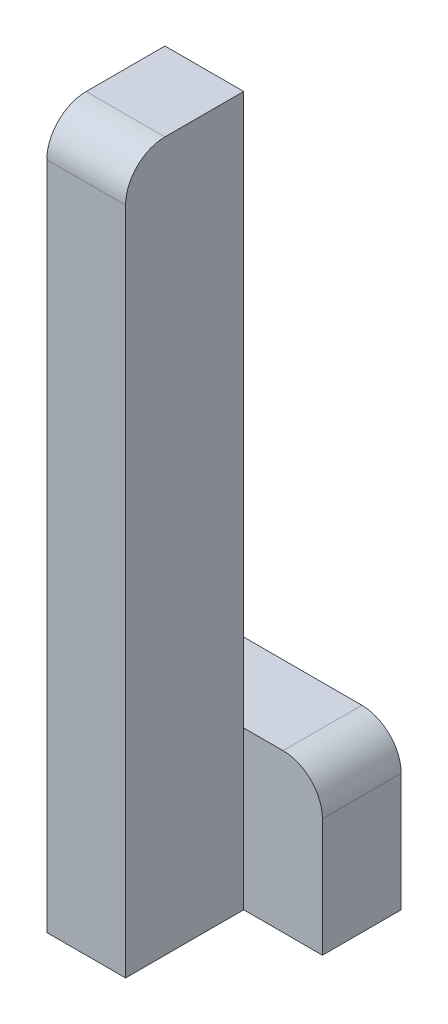
ISO-10303-21;
HEADER;
FILE_DESCRIPTION(('STEP AP214'),'2;1');
FILE_NAME('part.step','',(''),(''),'','','');
FILE_SCHEMA(('AUTOMOTIVE_DESIGN { 1 0 10303 214 1 1 1 1 }'));
ENDSEC;
DATA;
#1=APPLICATION_CONTEXT('core data for automotive mechanical design processes');
#2=APPLICATION_PROTOCOL_DEFINITION('international standard','automotive_design',2000,#1);
#3=PRODUCT_CONTEXT('',#1,'mechanical');
#4=PRODUCT('Part','Part','',(#3));
#5=PRODUCT_RELATED_PRODUCT_CATEGORY('part','',(#4));
#6=PRODUCT_DEFINITION_FORMATION('','',#4);
#7=PRODUCT_DEFINITION_CONTEXT('part definition',#1,'design');
#8=PRODUCT_DEFINITION('design','',#6,#7);
#9=PRODUCT_DEFINITION_SHAPE('','',#8);
#10=(LENGTH_UNIT() NAMED_UNIT(*) SI_UNIT(.MILLI.,.METRE.));
#11=(NAMED_UNIT(*) PLANE_ANGLE_UNIT() SI_UNIT($,.RADIAN.));
#12=(NAMED_UNIT(*) SI_UNIT($,.STERADIAN.) SOLID_ANGLE_UNIT());
#13=UNCERTAINTY_MEASURE_WITH_UNIT(LENGTH_MEASURE(1.E-05),#10,'distance_accuracy_value','');
#14=(GEOMETRIC_REPRESENTATION_CONTEXT(3) GLOBAL_UNCERTAINTY_ASSIGNED_CONTEXT((#13)) GLOBAL_UNIT_ASSIGNED_CONTEXT((#10,
#11,#12)) REPRESENTATION_CONTEXT('',''));
#15=CARTESIAN_POINT('',(0.,0.,0.));
#16=DIRECTION('',(0.,0.,1.));
#17=DIRECTION('',(1.,0.,0.));
#18=AXIS2_PLACEMENT_3D('',#15,#16,#17);
#19=CARTESIAN_POINT('',(-10.,0.,30.));
#20=DIRECTION('',(0.,-1.,0.));
#21=DIRECTION('',(1.,0.,0.));
#22=AXIS2_PLACEMENT_3D('',#19,#20,#21);
#23=PLANE('',#22);
#24=DIRECTION('',(0.,0.,-1.));
#25=VECTOR('',#24,1.);
#26=CARTESIAN_POINT('',(-30.,0.,30.));
#27=LINE('',#26,#25);
#28=CARTESIAN_POINT('',(-30.,0.,20.));
#29=VERTEX_POINT('',#28);
#30=CARTESIAN_POINT('',(-30.,0.,0.));
#31=VERTEX_POINT('',#30);
#32=EDGE_CURVE('E171',#29,#31,#27,.T.);
#33=ORIENTED_EDGE('',*,*,#32,.F.);
#34=DIRECTION('',(-1.,0.,0.));
#35=VECTOR('',#34,1.);
#36=CARTESIAN_POINT('',(-10.,0.,20.));
#37=LINE('',#36,#35);
#38=CARTESIAN_POINT('',(-10.,0.,20.));
#39=VERTEX_POINT('',#38);
#40=EDGE_CURVE('E43',#29,#39,#37,.F.);
#41=ORIENTED_EDGE('',*,*,#40,.T.);
#42=DIRECTION('',(0.,0.,-1.));
#43=VECTOR('',#42,1.);
#44=CARTESIAN_POINT('',(-10.,0.,30.));
#45=LINE('',#44,#43);
#46=CARTESIAN_POINT('',(-10.,0.,0.));
#47=VERTEX_POINT('',#46);
#48=EDGE_CURVE('E158',#39,#47,#45,.T.);
#49=ORIENTED_EDGE('',*,*,#48,.T.);
#50=DIRECTION('',(-1.,0.,0.));
#51=VECTOR('',#50,1.);
#52=CARTESIAN_POINT('',(-10.,0.,0.));
#53=LINE('',#52,#51);
#54=EDGE_CURVE('E148',#47,#31,#53,.T.);
#55=ORIENTED_EDGE('',*,*,#54,.T.);
#56=EDGE_LOOP('',(#33,#41,#49,#55));
#57=FACE_BOUND('',#56,.T.);
#58=ADVANCED_FACE('F35',(#57),#23,.F.);
#59=CARTESIAN_POINT('',(-30.,0.,30.));
#60=DIRECTION('',(1.,0.,0.));
#61=DIRECTION('',(0.,0.,-1.));
#62=AXIS2_PLACEMENT_3D('',#59,#60,#61);
#63=PLANE('',#62);
#64=DIRECTION('',(0.,-1.,0.));
#65=VECTOR('',#64,1.);
#66=CARTESIAN_POINT('',(-30.,0.,30.));
#67=LINE('',#66,#65);
#68=CARTESIAN_POINT('',(-30.,-10.,30.));
#69=VERTEX_POINT('',#68);
#70=CARTESIAN_POINT('',(-30.,-180.,30.));
#71=VERTEX_POINT('',#70);
#72=EDGE_CURVE('E150',#69,#71,#67,.T.);
#73=ORIENTED_EDGE('',*,*,#72,.F.);
#74=CARTESIAN_POINT('',(-30.,-10.,20.));
#75=DIRECTION('',(1.,0.,0.));
#76=DIRECTION('',(0.,0.,-1.));
#77=AXIS2_PLACEMENT_3D('',#74,#75,#76);
#78=CIRCLE('',#77,10.);
#79=EDGE_CURVE('E57',#69,#29,#78,.F.);
#80=ORIENTED_EDGE('',*,*,#79,.T.);
#81=ORIENTED_EDGE('',*,*,#32,.T.);
#82=DIRECTION('',(0.,-1.,0.));
#83=VECTOR('',#82,1.);
#84=CARTESIAN_POINT('',(-30.,0.,0.));
#85=LINE('',#84,#83);
#86=CARTESIAN_POINT('',(-30.,-140.,0.));
#87=VERTEX_POINT('',#86);
#88=EDGE_CURVE('E126',#31,#87,#85,.T.);
#89=ORIENTED_EDGE('',*,*,#88,.T.);
#90=DIRECTION('',(0.,0.,1.));
#91=VECTOR('',#90,1.);
#92=CARTESIAN_POINT('',(-30.,-140.,-20.));
#93=LINE('',#92,#91);
#94=CARTESIAN_POINT('',(-30.,-140.,-20.));
#95=VERTEX_POINT('',#94);
#96=EDGE_CURVE('E111',#95,#87,#93,.T.);
#97=ORIENTED_EDGE('',*,*,#96,.F.);
#98=DIRECTION('',(0.,-1.,0.));
#99=VECTOR('',#98,1.);
#100=CARTESIAN_POINT('',(-30.,-140.,-20.));
#101=LINE('',#100,#99);
#102=CARTESIAN_POINT('',(-30.,-180.,-20.));
#103=VERTEX_POINT('',#102);
#104=EDGE_CURVE('E118',#95,#103,#101,.T.);
#105=ORIENTED_EDGE('',*,*,#104,.T.);
#106=DIRECTION('',(0.,0.,-1.));
#107=VECTOR('',#106,1.);
#108=CARTESIAN_POINT('',(-30.,-180.,30.));
#109=LINE('',#108,#107);
#110=EDGE_CURVE('E169',#71,#103,#109,.T.);
#111=ORIENTED_EDGE('',*,*,#110,.F.);
#112=EDGE_LOOP('',(#73,#80,#81,#89,#97,#105,#111));
#113=FACE_BOUND('',#112,.T.);
#114=ADVANCED_FACE('F123',(#113),#63,.F.);
#115=CARTESIAN_POINT('',(-30.,-180.,30.));
#116=DIRECTION('',(0.,1.,0.));
#117=DIRECTION('',(0.,0.,1.));
#118=AXIS2_PLACEMENT_3D('',#115,#116,#117);
#119=PLANE('',#118);
#120=ORIENTED_EDGE('',*,*,#110,.T.);
#121=DIRECTION('',(1.,0.,0.));
#122=VECTOR('',#121,1.);
#123=CARTESIAN_POINT('',(-30.,-180.,-20.));
#124=LINE('',#123,#122);
#125=CARTESIAN_POINT('',(10.,-180.,-20.));
#126=VERTEX_POINT('',#125);
#127=EDGE_CURVE('E134',#103,#126,#124,.T.);
#128=ORIENTED_EDGE('',*,*,#127,.T.);
#129=DIRECTION('',(0.,0.,1.));
#130=VECTOR('',#129,1.);
#131=CARTESIAN_POINT('',(10.,-180.,-20.));
#132=LINE('',#131,#130);
#133=CARTESIAN_POINT('',(10.,-180.,0.));
#134=VERTEX_POINT('',#133);
#135=EDGE_CURVE('E127',#126,#134,#132,.T.);
#136=ORIENTED_EDGE('',*,*,#135,.T.);
#137=DIRECTION('',(1.,0.,0.));
#138=VECTOR('',#137,1.);
#139=CARTESIAN_POINT('',(-30.,-180.,0.));
#140=LINE('',#139,#138);
#141=CARTESIAN_POINT('',(-10.,-180.,0.));
#142=VERTEX_POINT('',#141);
#143=EDGE_CURVE('E142',#142,#134,#140,.T.);
#144=ORIENTED_EDGE('',*,*,#143,.F.);
#145=DIRECTION('',(0.,0.,-1.));
#146=VECTOR('',#145,1.);
#147=CARTESIAN_POINT('',(-10.,-180.,30.));
#148=LINE('',#147,#146);
#149=CARTESIAN_POINT('',(-10.,-180.,30.));
#150=VERTEX_POINT('',#149);
#151=EDGE_CURVE('E166',#150,#142,#148,.T.);
#152=ORIENTED_EDGE('',*,*,#151,.F.);
#153=DIRECTION('',(1.,0.,0.));
#154=VECTOR('',#153,1.);
#155=CARTESIAN_POINT('',(-30.,-180.,30.));
#156=LINE('',#155,#154);
#157=EDGE_CURVE('E152',#71,#150,#156,.T.);
#158=ORIENTED_EDGE('',*,*,#157,.F.);
#159=EDGE_LOOP('',(#120,#128,#136,#144,#152,#158));
#160=FACE_BOUND('',#159,.T.);
#161=ADVANCED_FACE('F193',(#160),#119,.F.);
#162=CARTESIAN_POINT('',(-10.,-180.,30.));
#163=DIRECTION('',(-1.,0.,0.));
#164=DIRECTION('',(0.,0.,1.));
#165=AXIS2_PLACEMENT_3D('',#162,#163,#164);
#166=PLANE('',#165);
#167=ORIENTED_EDGE('',*,*,#48,.F.);
#168=CARTESIAN_POINT('',(-10.,-10.,20.));
#169=DIRECTION('',(-1.,0.,0.));
#170=DIRECTION('',(0.,0.,1.));
#171=AXIS2_PLACEMENT_3D('',#168,#169,#170);
#172=CIRCLE('',#171,10.);
#173=CARTESIAN_POINT('',(-10.,-10.0000000000001,30.));
#174=VERTEX_POINT('',#173);
#175=EDGE_CURVE('E11',#39,#174,#172,.F.);
#176=ORIENTED_EDGE('',*,*,#175,.T.);
#177=DIRECTION('',(0.,1.,0.));
#178=VECTOR('',#177,1.);
#179=CARTESIAN_POINT('',(-10.,-180.,30.));
#180=LINE('',#179,#178);
#181=EDGE_CURVE('E155',#150,#174,#180,.T.);
#182=ORIENTED_EDGE('',*,*,#181,.F.);
#183=ORIENTED_EDGE('',*,*,#151,.T.);
#184=DIRECTION('',(0.,1.,0.));
#185=VECTOR('',#184,1.);
#186=CARTESIAN_POINT('',(-10.,-180.,0.));
#187=LINE('',#186,#185);
#188=CARTESIAN_POINT('',(-10.,-140.,0.));
#189=VERTEX_POINT('',#188);
#190=EDGE_CURVE('E153',#142,#189,#187,.T.);
#191=ORIENTED_EDGE('',*,*,#190,.T.);
#192=EDGE_CURVE('E162',#189,#47,#187,.T.);
#193=ORIENTED_EDGE('',*,*,#192,.T.);
#194=EDGE_LOOP('',(#167,#176,#182,#183,#191,#193));
#195=FACE_BOUND('',#194,.T.);
#196=ADVANCED_FACE('F196',(#195),#166,.F.);
#197=CARTESIAN_POINT('',(0.,0.,30.));
#198=DIRECTION('',(0.,0.,1.));
#199=DIRECTION('',(1.,0.,0.));
#200=AXIS2_PLACEMENT_3D('',#197,#198,#199);
#201=PLANE('',#200);
#202=ORIENTED_EDGE('',*,*,#181,.T.);
#203=DIRECTION('',(-1.,0.,0.));
#204=VECTOR('',#203,1.);
#205=CARTESIAN_POINT('',(-30.,-10.,30.));
#206=LINE('',#205,#204);
#207=EDGE_CURVE('E181',#174,#69,#206,.T.);
#208=ORIENTED_EDGE('',*,*,#207,.T.);
#209=ORIENTED_EDGE('',*,*,#72,.T.);
#210=ORIENTED_EDGE('',*,*,#157,.T.);
#211=EDGE_LOOP('',(#202,#208,#209,#210));
#212=FACE_BOUND('',#211,.T.);
#213=ADVANCED_FACE('F186',(#212),#201,.T.);
#214=CARTESIAN_POINT('',(0.,0.,0.));
#215=DIRECTION('',(0.,0.,1.));
#216=DIRECTION('',(1.,0.,0.));
#217=AXIS2_PLACEMENT_3D('',#214,#215,#216);
#218=PLANE('',#217);
#219=ORIENTED_EDGE('',*,*,#192,.F.);
#220=DIRECTION('',(-1.,0.,0.));
#221=VECTOR('',#220,1.);
#222=CARTESIAN_POINT('',(10.,-140.,0.));
#223=LINE('',#222,#221);
#224=EDGE_CURVE('E143',#189,#87,#223,.T.);
#225=ORIENTED_EDGE('',*,*,#224,.T.);
#226=ORIENTED_EDGE('',*,*,#88,.F.);
#227=ORIENTED_EDGE('',*,*,#54,.F.);
#228=EDGE_LOOP('',(#219,#225,#226,#227));
#229=FACE_BOUND('',#228,.T.);
#230=ADVANCED_FACE('F215',(#229),#218,.F.);
#231=CARTESIAN_POINT('',(0.,0.,0.));
#232=DIRECTION('',(0.,0.,1.));
#233=DIRECTION('',(1.,0.,0.));
#234=AXIS2_PLACEMENT_3D('',#231,#232,#233);
#235=PLANE('',#234);
#236=DIRECTION('',(0.,1.,0.));
#237=VECTOR('',#236,1.);
#238=CARTESIAN_POINT('',(10.,-180.,0.));
#239=LINE('',#238,#237);
#240=CARTESIAN_POINT('',(10.,-150.,0.));
#241=VERTEX_POINT('',#240);
#242=EDGE_CURVE('E119',#134,#241,#239,.T.);
#243=ORIENTED_EDGE('',*,*,#242,.T.);
#244=CARTESIAN_POINT('',(0.,-150.,0.));
#245=DIRECTION('',(0.,0.,1.));
#246=DIRECTION('',(1.,0.,0.));
#247=AXIS2_PLACEMENT_3D('',#244,#245,#246);
#248=CIRCLE('',#247,10.);
#249=CARTESIAN_POINT('',(0.,-140.,0.));
#250=VERTEX_POINT('',#249);
#251=EDGE_CURVE('E176',#241,#250,#248,.T.);
#252=ORIENTED_EDGE('',*,*,#251,.T.);
#253=EDGE_CURVE('E140',#250,#189,#223,.T.);
#254=ORIENTED_EDGE('',*,*,#253,.T.);
#255=ORIENTED_EDGE('',*,*,#190,.F.);
#256=ORIENTED_EDGE('',*,*,#143,.T.);
#257=EDGE_LOOP('',(#243,#252,#254,#255,#256));
#258=FACE_BOUND('',#257,.T.);
#259=ADVANCED_FACE('F218',(#258),#235,.T.);
#260=CARTESIAN_POINT('',(10.,-140.,-20.));
#261=DIRECTION('',(0.,1.,0.));
#262=DIRECTION('',(0.,0.,1.));
#263=AXIS2_PLACEMENT_3D('',#260,#261,#262);
#264=PLANE('',#263);
#265=ORIENTED_EDGE('',*,*,#253,.F.);
#266=DIRECTION('',(0.,0.,1.));
#267=VECTOR('',#266,1.);
#268=CARTESIAN_POINT('',(0.,-140.,-20.));
#269=LINE('',#268,#267);
#270=CARTESIAN_POINT('',(0.,-140.,-20.));
#271=VERTEX_POINT('',#270);
#272=EDGE_CURVE('E114',#250,#271,#269,.F.);
#273=ORIENTED_EDGE('',*,*,#272,.T.);
#274=DIRECTION('',(-1.,0.,0.));
#275=VECTOR('',#274,1.);
#276=CARTESIAN_POINT('',(10.,-140.,-20.));
#277=LINE('',#276,#275);
#278=EDGE_CURVE('E106',#271,#95,#277,.T.);
#279=ORIENTED_EDGE('',*,*,#278,.T.);
#280=ORIENTED_EDGE('',*,*,#96,.T.);
#281=ORIENTED_EDGE('',*,*,#224,.F.);
#282=EDGE_LOOP('',(#265,#273,#279,#280,#281));
#283=FACE_BOUND('',#282,.T.);
#284=ADVANCED_FACE('F109',(#283),#264,.T.);
#285=CARTESIAN_POINT('',(10.,-180.,-20.));
#286=DIRECTION('',(1.,0.,0.));
#287=DIRECTION('',(0.,0.,-1.));
#288=AXIS2_PLACEMENT_3D('',#285,#286,#287);
#289=PLANE('',#288);
#290=DIRECTION('',(0.,1.,0.));
#291=VECTOR('',#290,1.);
#292=CARTESIAN_POINT('',(10.,-180.,-20.));
#293=LINE('',#292,#291);
#294=CARTESIAN_POINT('',(10.,-150.,-20.));
#295=VERTEX_POINT('',#294);
#296=EDGE_CURVE('E128',#126,#295,#293,.T.);
#297=ORIENTED_EDGE('',*,*,#296,.T.);
#298=DIRECTION('',(0.,0.,1.));
#299=VECTOR('',#298,1.);
#300=CARTESIAN_POINT('',(10.,-150.,-20.));
#301=LINE('',#300,#299);
#302=EDGE_CURVE('E173',#295,#241,#301,.T.);
#303=ORIENTED_EDGE('',*,*,#302,.T.);
#304=ORIENTED_EDGE('',*,*,#242,.F.);
#305=ORIENTED_EDGE('',*,*,#135,.F.);
#306=EDGE_LOOP('',(#297,#303,#304,#305));
#307=FACE_BOUND('',#306,.T.);
#308=ADVANCED_FACE('F224',(#307),#289,.T.);
#309=CARTESIAN_POINT('',(0.,0.,-20.));
#310=DIRECTION('',(0.,0.,1.));
#311=DIRECTION('',(1.,0.,0.));
#312=AXIS2_PLACEMENT_3D('',#309,#310,#311);
#313=PLANE('',#312);
#314=ORIENTED_EDGE('',*,*,#278,.F.);
#315=CARTESIAN_POINT('',(0.,-150.,-20.));
#316=DIRECTION('',(0.,0.,1.));
#317=DIRECTION('',(1.,0.,0.));
#318=AXIS2_PLACEMENT_3D('',#315,#316,#317);
#319=CIRCLE('',#318,10.);
#320=EDGE_CURVE('E179',#271,#295,#319,.F.);
#321=ORIENTED_EDGE('',*,*,#320,.T.);
#322=ORIENTED_EDGE('',*,*,#296,.F.);
#323=ORIENTED_EDGE('',*,*,#127,.F.);
#324=ORIENTED_EDGE('',*,*,#104,.F.);
#325=EDGE_LOOP('',(#314,#321,#322,#323,#324));
#326=FACE_BOUND('',#325,.T.);
#327=ADVANCED_FACE('F131',(#326),#313,.F.);
#328=CARTESIAN_POINT('',(0.,-150.,-20.));
#329=DIRECTION('',(0.,0.,1.));
#330=DIRECTION('',(1.,0.,0.));
#331=AXIS2_PLACEMENT_3D('',#328,#329,#330);
#332=CYLINDRICAL_SURFACE('',#331,10.);
#333=ORIENTED_EDGE('',*,*,#320,.F.);
#334=ORIENTED_EDGE('',*,*,#272,.F.);
#335=ORIENTED_EDGE('',*,*,#251,.F.);
#336=ORIENTED_EDGE('',*,*,#302,.F.);
#337=EDGE_LOOP('',(#333,#334,#335,#336));
#338=FACE_BOUND('',#337,.T.);
#339=ADVANCED_FACE('F199',(#338),#332,.T.);
#340=CARTESIAN_POINT('',(0.,-10.,20.));
#341=DIRECTION('',(1.,0.,0.));
#342=DIRECTION('',(0.,1.,0.));
#343=AXIS2_PLACEMENT_3D('',#340,#341,#342);
#344=CYLINDRICAL_SURFACE('',#343,10.);
#345=ORIENTED_EDGE('',*,*,#175,.F.);
#346=ORIENTED_EDGE('',*,*,#40,.F.);
#347=ORIENTED_EDGE('',*,*,#79,.F.);
#348=ORIENTED_EDGE('',*,*,#207,.F.);
#349=EDGE_LOOP('',(#345,#346,#347,#348));
#350=FACE_BOUND('',#349,.T.);
#351=ADVANCED_FACE('F37',(#350),#344,.T.);
#352=CLOSED_SHELL('',(#58,#114,#161,#196,#213,#230,#259,#284,#308,#327,#339,#351));
#353=MANIFOLD_SOLID_BREP('B2',#352);
#354=ADVANCED_BREP_SHAPE_REPRESENTATION('',(#18,#353),#14);
#355=SHAPE_DEFINITION_REPRESENTATION(#9,#354);
ENDSEC;
END-ISO-10303-21;
